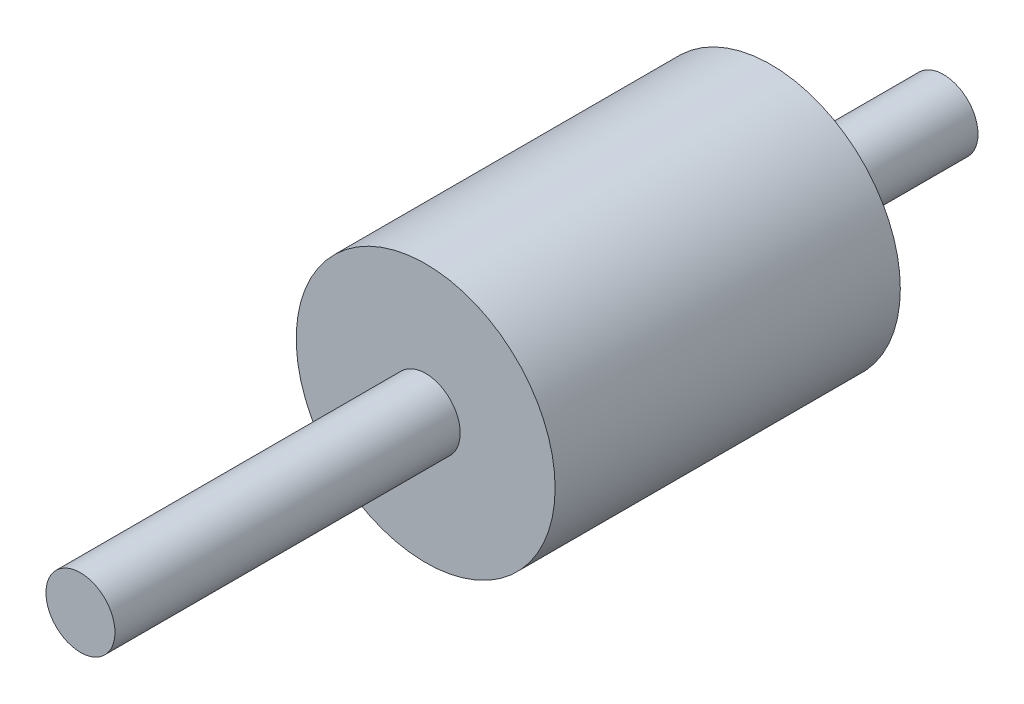
ISO-10303-21;
HEADER;
FILE_DESCRIPTION(('STEP AP214'),'2;1');
FILE_NAME('part.step','',(''),(''),'','','');
FILE_SCHEMA(('AUTOMOTIVE_DESIGN { 1 0 10303 214 1 1 1 1 }'));
ENDSEC;
DATA;
#1=APPLICATION_CONTEXT('core data for automotive mechanical design processes');
#2=APPLICATION_PROTOCOL_DEFINITION('international standard','automotive_design',2000,#1);
#3=PRODUCT_CONTEXT('',#1,'mechanical');
#4=PRODUCT('Part','Part','',(#3));
#5=PRODUCT_RELATED_PRODUCT_CATEGORY('part','',(#4));
#6=PRODUCT_DEFINITION_FORMATION('','',#4);
#7=PRODUCT_DEFINITION_CONTEXT('part definition',#1,'design');
#8=PRODUCT_DEFINITION('design','',#6,#7);
#9=PRODUCT_DEFINITION_SHAPE('','',#8);
#10=(LENGTH_UNIT() NAMED_UNIT(*) SI_UNIT(.MILLI.,.METRE.));
#11=(NAMED_UNIT(*) PLANE_ANGLE_UNIT() SI_UNIT($,.RADIAN.));
#12=(NAMED_UNIT(*) SI_UNIT($,.STERADIAN.) SOLID_ANGLE_UNIT());
#13=UNCERTAINTY_MEASURE_WITH_UNIT(LENGTH_MEASURE(1.E-05),#10,'distance_accuracy_value','');
#14=(GEOMETRIC_REPRESENTATION_CONTEXT(3) GLOBAL_UNCERTAINTY_ASSIGNED_CONTEXT((#13)) GLOBAL_UNIT_ASSIGNED_CONTEXT((#10,
#11,#12)) REPRESENTATION_CONTEXT('',''));
#15=CARTESIAN_POINT('',(0.,0.,0.));
#16=DIRECTION('',(0.,0.,1.));
#17=DIRECTION('',(1.,0.,0.));
#18=AXIS2_PLACEMENT_3D('',#15,#16,#17);
#19=CARTESIAN_POINT('',(0.,0.,20.));
#20=DIRECTION('',(0.,0.,-1.));
#21=DIRECTION('',(-1.,0.,0.));
#22=AXIS2_PLACEMENT_3D('',#19,#20,#21);
#23=CYLINDRICAL_SURFACE('',#22,7.5);
#24=CARTESIAN_POINT('',(0.,0.,20.));
#25=DIRECTION('',(0.,0.,1.));
#26=DIRECTION('',(1.,0.,0.));
#27=AXIS2_PLACEMENT_3D('',#24,#25,#26);
#28=CIRCLE('',#27,7.5);
#29=CARTESIAN_POINT('',(7.5,0.,20.));
#30=VERTEX_POINT('',#29);
#31=EDGE_CURVE('E43',#30,#30,#28,.T.);
#32=ORIENTED_EDGE('',*,*,#31,.F.);
#33=EDGE_LOOP('',(#32));
#34=FACE_BOUND('',#33,.T.);
#35=CARTESIAN_POINT('',(0.,0.,0.));
#36=DIRECTION('',(0.,0.,1.));
#37=DIRECTION('',(1.,0.,0.));
#38=AXIS2_PLACEMENT_3D('',#35,#36,#37);
#39=CIRCLE('',#38,7.5);
#40=CARTESIAN_POINT('',(7.5,0.,0.));
#41=VERTEX_POINT('',#40);
#42=EDGE_CURVE('E47',#41,#41,#39,.T.);
#43=ORIENTED_EDGE('',*,*,#42,.T.);
#44=EDGE_LOOP('',(#43));
#45=FACE_BOUND('',#44,.T.);
#46=ADVANCED_FACE('F37',(#34,#45),#23,.T.);
#47=CARTESIAN_POINT('',(0.,0.,20.));
#48=DIRECTION('',(0.,0.,1.));
#49=DIRECTION('',(1.,0.,0.));
#50=AXIS2_PLACEMENT_3D('',#47,#48,#49);
#51=PLANE('',#50);
#52=CARTESIAN_POINT('',(0.,0.,20.));
#53=DIRECTION('',(0.,0.,1.));
#54=DIRECTION('',(1.,0.,0.));
#55=AXIS2_PLACEMENT_3D('',#52,#53,#54);
#56=CIRCLE('',#55,2.);
#57=CARTESIAN_POINT('',(2.,0.,20.));
#58=VERTEX_POINT('',#57);
#59=EDGE_CURVE('E52',#58,#58,#56,.F.);
#60=ORIENTED_EDGE('',*,*,#59,.T.);
#61=EDGE_LOOP('',(#60));
#62=FACE_BOUND('',#61,.T.);
#63=ORIENTED_EDGE('',*,*,#31,.T.);
#64=EDGE_LOOP('',(#63));
#65=FACE_BOUND('',#64,.T.);
#66=ADVANCED_FACE('F79',(#62,#65),#51,.T.);
#67=CARTESIAN_POINT('',(0.,0.,0.));
#68=DIRECTION('',(0.,0.,1.));
#69=DIRECTION('',(1.,0.,0.));
#70=AXIS2_PLACEMENT_3D('',#67,#68,#69);
#71=PLANE('',#70);
#72=CARTESIAN_POINT('',(0.,0.,0.));
#73=DIRECTION('',(0.,0.,1.));
#74=DIRECTION('',(1.,0.,0.));
#75=AXIS2_PLACEMENT_3D('',#72,#73,#74);
#76=CIRCLE('',#75,2.);
#77=CARTESIAN_POINT('',(2.,0.,0.));
#78=VERTEX_POINT('',#77);
#79=EDGE_CURVE('E10',#78,#78,#76,.F.);
#80=ORIENTED_EDGE('',*,*,#79,.F.);
#81=EDGE_LOOP('',(#80));
#82=FACE_BOUND('',#81,.T.);
#83=ORIENTED_EDGE('',*,*,#42,.F.);
#84=EDGE_LOOP('',(#83));
#85=FACE_BOUND('',#84,.T.);
#86=ADVANCED_FACE('F84',(#82,#85),#71,.F.);
#87=CARTESIAN_POINT('',(0.,0.,40.));
#88=DIRECTION('',(0.,0.,-1.));
#89=DIRECTION('',(-1.,0.,0.));
#90=AXIS2_PLACEMENT_3D('',#87,#88,#89);
#91=CYLINDRICAL_SURFACE('',#90,2.);
#92=ORIENTED_EDGE('',*,*,#59,.F.);
#93=EDGE_LOOP('',(#92));
#94=FACE_BOUND('',#93,.T.);
#95=CARTESIAN_POINT('',(0.,0.,40.));
#96=DIRECTION('',(0.,0.,1.));
#97=DIRECTION('',(1.,0.,0.));
#98=AXIS2_PLACEMENT_3D('',#95,#96,#97);
#99=CIRCLE('',#98,2.);
#100=CARTESIAN_POINT('',(2.,0.,40.));
#101=VERTEX_POINT('',#100);
#102=EDGE_CURVE('E56',#101,#101,#99,.T.);
#103=ORIENTED_EDGE('',*,*,#102,.F.);
#104=EDGE_LOOP('',(#103));
#105=FACE_BOUND('',#104,.T.);
#106=ADVANCED_FACE('F75',(#94,#105),#91,.T.);
#107=CARTESIAN_POINT('',(0.,0.,-10.));
#108=DIRECTION('',(0.,0.,1.));
#109=DIRECTION('',(1.,0.,0.));
#110=AXIS2_PLACEMENT_3D('',#107,#108,#109);
#111=CIRCLE('',#110,2.);
#112=CARTESIAN_POINT('',(2.,0.,-10.));
#113=VERTEX_POINT('',#112);
#114=EDGE_CURVE('E59',#113,#113,#111,.T.);
#115=ORIENTED_EDGE('',*,*,#114,.T.);
#116=EDGE_LOOP('',(#115));
#117=FACE_BOUND('',#116,.T.);
#118=ORIENTED_EDGE('',*,*,#79,.T.);
#119=EDGE_LOOP('',(#118));
#120=FACE_BOUND('',#119,.T.);
#121=ADVANCED_FACE('F63',(#117,#120),#91,.T.);
#122=CARTESIAN_POINT('',(0.,0.,-9.99999999999999));
#123=DIRECTION('',(0.,0.,1.));
#124=DIRECTION('',(1.,0.,0.));
#125=AXIS2_PLACEMENT_3D('',#122,#123,#124);
#126=PLANE('',#125);
#127=ORIENTED_EDGE('',*,*,#114,.F.);
#128=EDGE_LOOP('',(#127));
#129=FACE_BOUND('',#128,.T.);
#130=ADVANCED_FACE('F65',(#129),#126,.F.);
#131=CARTESIAN_POINT('',(0.,0.,40.));
#132=DIRECTION('',(0.,0.,1.));
#133=DIRECTION('',(1.,0.,0.));
#134=AXIS2_PLACEMENT_3D('',#131,#132,#133);
#135=PLANE('',#134);
#136=ORIENTED_EDGE('',*,*,#102,.T.);
#137=EDGE_LOOP('',(#136));
#138=FACE_BOUND('',#137,.T.);
#139=ADVANCED_FACE('F67',(#138),#135,.T.);
#140=CLOSED_SHELL('',(#46,#66,#86,#106,#121,#130,#139));
#141=MANIFOLD_SOLID_BREP('B2',#140);
#142=ADVANCED_BREP_SHAPE_REPRESENTATION('',(#18,#141),#14);
#143=SHAPE_DEFINITION_REPRESENTATION(#9,#142);
ENDSEC;
END-ISO-10303-21;
